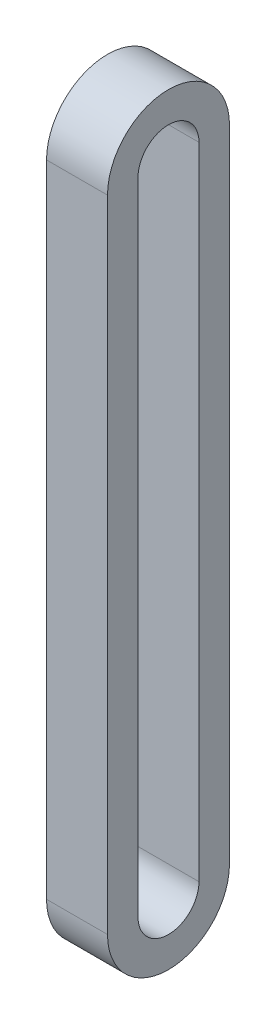
ISO-10303-21;
HEADER;
FILE_DESCRIPTION(('STEP AP214'),'2;1');
FILE_NAME('part.step','',(''),(''),'','','');
FILE_SCHEMA(('AUTOMOTIVE_DESIGN { 1 0 10303 214 1 1 1 1 }'));
ENDSEC;
DATA;
#1=APPLICATION_CONTEXT('core data for automotive mechanical design processes');
#2=APPLICATION_PROTOCOL_DEFINITION('international standard','automotive_design',2000,#1);
#3=PRODUCT_CONTEXT('',#1,'mechanical');
#4=PRODUCT('Part','Part','',(#3));
#5=PRODUCT_RELATED_PRODUCT_CATEGORY('part','',(#4));
#6=PRODUCT_DEFINITION_FORMATION('','',#4);
#7=PRODUCT_DEFINITION_CONTEXT('part definition',#1,'design');
#8=PRODUCT_DEFINITION('design','',#6,#7);
#9=PRODUCT_DEFINITION_SHAPE('','',#8);
#10=(LENGTH_UNIT() NAMED_UNIT(*) SI_UNIT(.MILLI.,.METRE.));
#11=(NAMED_UNIT(*) PLANE_ANGLE_UNIT() SI_UNIT($,.RADIAN.));
#12=(NAMED_UNIT(*) SI_UNIT($,.STERADIAN.) SOLID_ANGLE_UNIT());
#13=UNCERTAINTY_MEASURE_WITH_UNIT(LENGTH_MEASURE(1.E-05),#10,'distance_accuracy_value','');
#14=(GEOMETRIC_REPRESENTATION_CONTEXT(3) GLOBAL_UNCERTAINTY_ASSIGNED_CONTEXT((#13)) GLOBAL_UNIT_ASSIGNED_CONTEXT((#10,
#11,#12)) REPRESENTATION_CONTEXT('',''));
#15=CARTESIAN_POINT('',(0.,0.,0.));
#16=DIRECTION('',(0.,0.,1.));
#17=DIRECTION('',(1.,0.,0.));
#18=AXIS2_PLACEMENT_3D('',#15,#16,#17);
#19=CARTESIAN_POINT('',(30.,25.,0.));
#20=DIRECTION('',(1.,0.,0.));
#21=DIRECTION('',(0.,1.,0.));
#22=AXIS2_PLACEMENT_3D('',#19,#20,#21);
#23=PLANE('',#22);
#24=DIRECTION('',(0.,-1.,0.));
#25=VECTOR('',#24,1.);
#26=CARTESIAN_POINT('',(30.,130.,-10.));
#27=LINE('',#26,#25);
#28=CARTESIAN_POINT('',(30.,130.,-10.));
#29=VERTEX_POINT('',#28);
#30=CARTESIAN_POINT('',(30.,25.,-10.));
#31=VERTEX_POINT('',#30);
#32=EDGE_CURVE('E164',#29,#31,#27,.T.);
#33=ORIENTED_EDGE('',*,*,#32,.F.);
#34=CARTESIAN_POINT('',(30.,130.,0.));
#35=DIRECTION('',(1.,0.,0.));
#36=DIRECTION('',(0.,1.,0.));
#37=AXIS2_PLACEMENT_3D('',#34,#35,#36);
#38=CIRCLE('',#37,10.);
#39=CARTESIAN_POINT('',(30.,130.,10.));
#40=VERTEX_POINT('',#39);
#41=EDGE_CURVE('E172',#29,#40,#38,.T.);
#42=ORIENTED_EDGE('',*,*,#41,.T.);
#43=DIRECTION('',(0.,-1.,0.));
#44=VECTOR('',#43,1.);
#45=CARTESIAN_POINT('',(30.,130.,10.));
#46=LINE('',#45,#44);
#47=CARTESIAN_POINT('',(30.,25.,9.99999999999998));
#48=VERTEX_POINT('',#47);
#49=EDGE_CURVE('E170',#40,#48,#46,.T.);
#50=ORIENTED_EDGE('',*,*,#49,.T.);
#51=CARTESIAN_POINT('',(30.,25.,0.));
#52=DIRECTION('',(1.,0.,0.));
#53=DIRECTION('',(0.,1.,0.));
#54=AXIS2_PLACEMENT_3D('',#51,#52,#53);
#55=CIRCLE('',#54,10.);
#56=EDGE_CURVE('E167',#48,#31,#55,.T.);
#57=ORIENTED_EDGE('',*,*,#56,.T.);
#58=EDGE_LOOP('',(#33,#42,#50,#57));
#59=FACE_BOUND('',#58,.T.);
#60=DIRECTION('',(0.,-1.,0.));
#61=VECTOR('',#60,1.);
#62=CARTESIAN_POINT('',(30.,130.,5.));
#63=LINE('',#62,#61);
#64=CARTESIAN_POINT('',(30.,130.,5.));
#65=VERTEX_POINT('',#64);
#66=CARTESIAN_POINT('',(30.,25.,4.99999999999999));
#67=VERTEX_POINT('',#66);
#68=EDGE_CURVE('E137',#65,#67,#63,.T.);
#69=ORIENTED_EDGE('',*,*,#68,.F.);
#70=CARTESIAN_POINT('',(30.,130.,0.));
#71=DIRECTION('',(1.,0.,0.));
#72=DIRECTION('',(0.,1.,0.));
#73=AXIS2_PLACEMENT_3D('',#70,#71,#72);
#74=CIRCLE('',#73,5.);
#75=CARTESIAN_POINT('',(30.,130.,-5.));
#76=VERTEX_POINT('',#75);
#77=EDGE_CURVE('E129',#76,#65,#74,.T.);
#78=ORIENTED_EDGE('',*,*,#77,.F.);
#79=DIRECTION('',(0.,-1.,0.));
#80=VECTOR('',#79,1.);
#81=CARTESIAN_POINT('',(30.,130.,-5.));
#82=LINE('',#81,#80);
#83=CARTESIAN_POINT('',(30.,25.,-5.00000000000002));
#84=VERTEX_POINT('',#83);
#85=EDGE_CURVE('E151',#76,#84,#82,.T.);
#86=ORIENTED_EDGE('',*,*,#85,.T.);
#87=CARTESIAN_POINT('',(30.,25.,0.));
#88=DIRECTION('',(1.,0.,0.));
#89=DIRECTION('',(0.,1.,0.));
#90=AXIS2_PLACEMENT_3D('',#87,#88,#89);
#91=CIRCLE('',#90,5.);
#92=EDGE_CURVE('E149',#67,#84,#91,.T.);
#93=ORIENTED_EDGE('',*,*,#92,.F.);
#94=EDGE_LOOP('',(#69,#78,#86,#93));
#95=FACE_BOUND('',#94,.T.);
#96=ADVANCED_FACE('F63',(#59,#95),#23,.T.);
#97=CARTESIAN_POINT('',(20.,25.,0.));
#98=DIRECTION('',(1.,0.,0.));
#99=DIRECTION('',(0.,1.,0.));
#100=AXIS2_PLACEMENT_3D('',#97,#98,#99);
#101=PLANE('',#100);
#102=DIRECTION('',(0.,-1.,0.));
#103=VECTOR('',#102,1.);
#104=CARTESIAN_POINT('',(20.,130.,-10.));
#105=LINE('',#104,#103);
#106=CARTESIAN_POINT('',(20.,130.,-10.));
#107=VERTEX_POINT('',#106);
#108=CARTESIAN_POINT('',(20.,25.,-10.));
#109=VERTEX_POINT('',#108);
#110=EDGE_CURVE('E145',#107,#109,#105,.T.);
#111=ORIENTED_EDGE('',*,*,#110,.T.);
#112=CARTESIAN_POINT('',(20.,25.,0.));
#113=DIRECTION('',(1.,0.,0.));
#114=DIRECTION('',(0.,1.,0.));
#115=AXIS2_PLACEMENT_3D('',#112,#113,#114);
#116=CIRCLE('',#115,10.);
#117=CARTESIAN_POINT('',(20.,25.,9.99999999999998));
#118=VERTEX_POINT('',#117);
#119=EDGE_CURVE('E176',#118,#109,#116,.T.);
#120=ORIENTED_EDGE('',*,*,#119,.F.);
#121=DIRECTION('',(0.,-1.,0.));
#122=VECTOR('',#121,1.);
#123=CARTESIAN_POINT('',(20.,130.,10.));
#124=LINE('',#123,#122);
#125=CARTESIAN_POINT('',(20.,130.,10.));
#126=VERTEX_POINT('',#125);
#127=EDGE_CURVE('E179',#126,#118,#124,.T.);
#128=ORIENTED_EDGE('',*,*,#127,.F.);
#129=CARTESIAN_POINT('',(20.,130.,0.));
#130=DIRECTION('',(1.,0.,0.));
#131=DIRECTION('',(0.,1.,0.));
#132=AXIS2_PLACEMENT_3D('',#129,#130,#131);
#133=CIRCLE('',#132,10.);
#134=EDGE_CURVE('E168',#107,#126,#133,.T.);
#135=ORIENTED_EDGE('',*,*,#134,.F.);
#136=EDGE_LOOP('',(#111,#120,#128,#135));
#137=FACE_BOUND('',#136,.T.);
#138=CARTESIAN_POINT('',(20.,130.,0.));
#139=DIRECTION('',(1.,0.,0.));
#140=DIRECTION('',(0.,1.,0.));
#141=AXIS2_PLACEMENT_3D('',#138,#139,#140);
#142=CIRCLE('',#141,5.);
#143=CARTESIAN_POINT('',(20.,130.,-5.));
#144=VERTEX_POINT('',#143);
#145=CARTESIAN_POINT('',(20.,130.,5.));
#146=VERTEX_POINT('',#145);
#147=EDGE_CURVE('E88',#144,#146,#142,.T.);
#148=ORIENTED_EDGE('',*,*,#147,.T.);
#149=DIRECTION('',(0.,-1.,0.));
#150=VECTOR('',#149,1.);
#151=CARTESIAN_POINT('',(20.,130.,5.));
#152=LINE('',#151,#150);
#153=CARTESIAN_POINT('',(20.,25.,4.99999999999999));
#154=VERTEX_POINT('',#153);
#155=EDGE_CURVE('E144',#146,#154,#152,.T.);
#156=ORIENTED_EDGE('',*,*,#155,.T.);
#157=CARTESIAN_POINT('',(20.,25.,0.));
#158=DIRECTION('',(1.,0.,0.));
#159=DIRECTION('',(0.,1.,0.));
#160=AXIS2_PLACEMENT_3D('',#157,#158,#159);
#161=CIRCLE('',#160,5.);
#162=CARTESIAN_POINT('',(20.,25.,-5.00000000000002));
#163=VERTEX_POINT('',#162);
#164=EDGE_CURVE('E157',#154,#163,#161,.T.);
#165=ORIENTED_EDGE('',*,*,#164,.T.);
#166=DIRECTION('',(0.,-1.,0.));
#167=VECTOR('',#166,1.);
#168=CARTESIAN_POINT('',(20.,130.,-5.));
#169=LINE('',#168,#167);
#170=EDGE_CURVE('E138',#144,#163,#169,.T.);
#171=ORIENTED_EDGE('',*,*,#170,.F.);
#172=EDGE_LOOP('',(#148,#156,#165,#171));
#173=FACE_BOUND('',#172,.T.);
#174=ADVANCED_FACE('F197',(#137,#173),#101,.F.);
#175=CARTESIAN_POINT('',(30.,130.,-10.));
#176=DIRECTION('',(0.,0.,-1.));
#177=DIRECTION('',(0.,1.,0.));
#178=AXIS2_PLACEMENT_3D('',#175,#176,#177);
#179=PLANE('',#178);
#180=ORIENTED_EDGE('',*,*,#110,.F.);
#181=DIRECTION('',(-1.,0.,0.));
#182=VECTOR('',#181,1.);
#183=CARTESIAN_POINT('',(30.,130.,-10.));
#184=LINE('',#183,#182);
#185=EDGE_CURVE('E12',#29,#107,#184,.T.);
#186=ORIENTED_EDGE('',*,*,#185,.F.);
#187=ORIENTED_EDGE('',*,*,#32,.T.);
#188=DIRECTION('',(-1.,0.,0.));
#189=VECTOR('',#188,1.);
#190=CARTESIAN_POINT('',(30.,25.,-10.));
#191=LINE('',#190,#189);
#192=EDGE_CURVE('E67',#31,#109,#191,.T.);
#193=ORIENTED_EDGE('',*,*,#192,.T.);
#194=EDGE_LOOP('',(#180,#186,#187,#193));
#195=FACE_BOUND('',#194,.T.);
#196=ADVANCED_FACE('F65',(#195),#179,.T.);
#197=CARTESIAN_POINT('',(30.,130.,0.));
#198=DIRECTION('',(-1.,0.,0.));
#199=DIRECTION('',(0.,-1.,0.));
#200=AXIS2_PLACEMENT_3D('',#197,#198,#199);
#201=CYLINDRICAL_SURFACE('',#200,10.);
#202=ORIENTED_EDGE('',*,*,#134,.T.);
#203=DIRECTION('',(-1.,0.,0.));
#204=VECTOR('',#203,1.);
#205=CARTESIAN_POINT('',(30.,130.,10.));
#206=LINE('',#205,#204);
#207=EDGE_CURVE('E72',#40,#126,#206,.T.);
#208=ORIENTED_EDGE('',*,*,#207,.F.);
#209=ORIENTED_EDGE('',*,*,#41,.F.);
#210=ORIENTED_EDGE('',*,*,#185,.T.);
#211=EDGE_LOOP('',(#202,#208,#209,#210));
#212=FACE_BOUND('',#211,.T.);
#213=ADVANCED_FACE('F201',(#212),#201,.T.);
#214=CARTESIAN_POINT('',(30.,130.,10.));
#215=DIRECTION('',(0.,0.,-1.));
#216=DIRECTION('',(0.,1.,0.));
#217=AXIS2_PLACEMENT_3D('',#214,#215,#216);
#218=PLANE('',#217);
#219=ORIENTED_EDGE('',*,*,#127,.T.);
#220=DIRECTION('',(-1.,0.,0.));
#221=VECTOR('',#220,1.);
#222=CARTESIAN_POINT('',(30.,25.,9.99999999999998));
#223=LINE('',#222,#221);
#224=EDGE_CURVE('E183',#48,#118,#223,.T.);
#225=ORIENTED_EDGE('',*,*,#224,.F.);
#226=ORIENTED_EDGE('',*,*,#49,.F.);
#227=ORIENTED_EDGE('',*,*,#207,.T.);
#228=EDGE_LOOP('',(#219,#225,#226,#227));
#229=FACE_BOUND('',#228,.T.);
#230=ADVANCED_FACE('F205',(#229),#218,.F.);
#231=CARTESIAN_POINT('',(30.,25.,0.));
#232=DIRECTION('',(-1.,0.,0.));
#233=DIRECTION('',(0.,-1.,0.));
#234=AXIS2_PLACEMENT_3D('',#231,#232,#233);
#235=CYLINDRICAL_SURFACE('',#234,10.);
#236=ORIENTED_EDGE('',*,*,#119,.T.);
#237=ORIENTED_EDGE('',*,*,#192,.F.);
#238=ORIENTED_EDGE('',*,*,#56,.F.);
#239=ORIENTED_EDGE('',*,*,#224,.T.);
#240=EDGE_LOOP('',(#236,#237,#238,#239));
#241=FACE_BOUND('',#240,.T.);
#242=ADVANCED_FACE('F193',(#241),#235,.T.);
#243=CARTESIAN_POINT('',(30.,130.,0.));
#244=DIRECTION('',(-1.,0.,0.));
#245=DIRECTION('',(0.,-1.,0.));
#246=AXIS2_PLACEMENT_3D('',#243,#244,#245);
#247=CYLINDRICAL_SURFACE('',#246,5.);
#248=ORIENTED_EDGE('',*,*,#147,.F.);
#249=DIRECTION('',(-1.,0.,0.));
#250=VECTOR('',#249,1.);
#251=CARTESIAN_POINT('',(30.,130.,-5.));
#252=LINE('',#251,#250);
#253=EDGE_CURVE('E133',#76,#144,#252,.T.);
#254=ORIENTED_EDGE('',*,*,#253,.F.);
#255=ORIENTED_EDGE('',*,*,#77,.T.);
#256=DIRECTION('',(-1.,0.,0.));
#257=VECTOR('',#256,1.);
#258=CARTESIAN_POINT('',(30.,130.,5.));
#259=LINE('',#258,#257);
#260=EDGE_CURVE('E132',#65,#146,#259,.T.);
#261=ORIENTED_EDGE('',*,*,#260,.T.);
#262=EDGE_LOOP('',(#248,#254,#255,#261));
#263=FACE_BOUND('',#262,.T.);
#264=ADVANCED_FACE('F131',(#263),#247,.F.);
#265=CARTESIAN_POINT('',(30.,130.,5.));
#266=DIRECTION('',(0.,0.,-1.));
#267=DIRECTION('',(0.,1.,0.));
#268=AXIS2_PLACEMENT_3D('',#265,#266,#267);
#269=PLANE('',#268);
#270=ORIENTED_EDGE('',*,*,#155,.F.);
#271=ORIENTED_EDGE('',*,*,#260,.F.);
#272=ORIENTED_EDGE('',*,*,#68,.T.);
#273=DIRECTION('',(-1.,0.,0.));
#274=VECTOR('',#273,1.);
#275=CARTESIAN_POINT('',(30.,25.,4.99999999999999));
#276=LINE('',#275,#274);
#277=EDGE_CURVE('E146',#67,#154,#276,.T.);
#278=ORIENTED_EDGE('',*,*,#277,.T.);
#279=EDGE_LOOP('',(#270,#271,#272,#278));
#280=FACE_BOUND('',#279,.T.);
#281=ADVANCED_FACE('F141',(#280),#269,.T.);
#282=CARTESIAN_POINT('',(30.,25.,0.));
#283=DIRECTION('',(-1.,0.,0.));
#284=DIRECTION('',(0.,-1.,0.));
#285=AXIS2_PLACEMENT_3D('',#282,#283,#284);
#286=CYLINDRICAL_SURFACE('',#285,5.);
#287=ORIENTED_EDGE('',*,*,#164,.F.);
#288=ORIENTED_EDGE('',*,*,#277,.F.);
#289=ORIENTED_EDGE('',*,*,#92,.T.);
#290=DIRECTION('',(-1.,0.,0.));
#291=VECTOR('',#290,1.);
#292=CARTESIAN_POINT('',(30.,25.,-5.00000000000002));
#293=LINE('',#292,#291);
#294=EDGE_CURVE('E80',#84,#163,#293,.T.);
#295=ORIENTED_EDGE('',*,*,#294,.T.);
#296=EDGE_LOOP('',(#287,#288,#289,#295));
#297=FACE_BOUND('',#296,.T.);
#298=ADVANCED_FACE('F226',(#297),#286,.F.);
#299=CARTESIAN_POINT('',(30.,130.,-5.));
#300=DIRECTION('',(0.,0.,-1.));
#301=DIRECTION('',(0.,1.,0.));
#302=AXIS2_PLACEMENT_3D('',#299,#300,#301);
#303=PLANE('',#302);
#304=ORIENTED_EDGE('',*,*,#170,.T.);
#305=ORIENTED_EDGE('',*,*,#294,.F.);
#306=ORIENTED_EDGE('',*,*,#85,.F.);
#307=ORIENTED_EDGE('',*,*,#253,.T.);
#308=EDGE_LOOP('',(#304,#305,#306,#307));
#309=FACE_BOUND('',#308,.T.);
#310=ADVANCED_FACE('F230',(#309),#303,.F.);
#311=CLOSED_SHELL('',(#96,#174,#196,#213,#230,#242,#264,#281,#298,#310));
#312=MANIFOLD_SOLID_BREP('B2',#311);
#313=ADVANCED_BREP_SHAPE_REPRESENTATION('',(#18,#312),#14);
#314=SHAPE_DEFINITION_REPRESENTATION(#9,#313);
ENDSEC;
END-ISO-10303-21;
